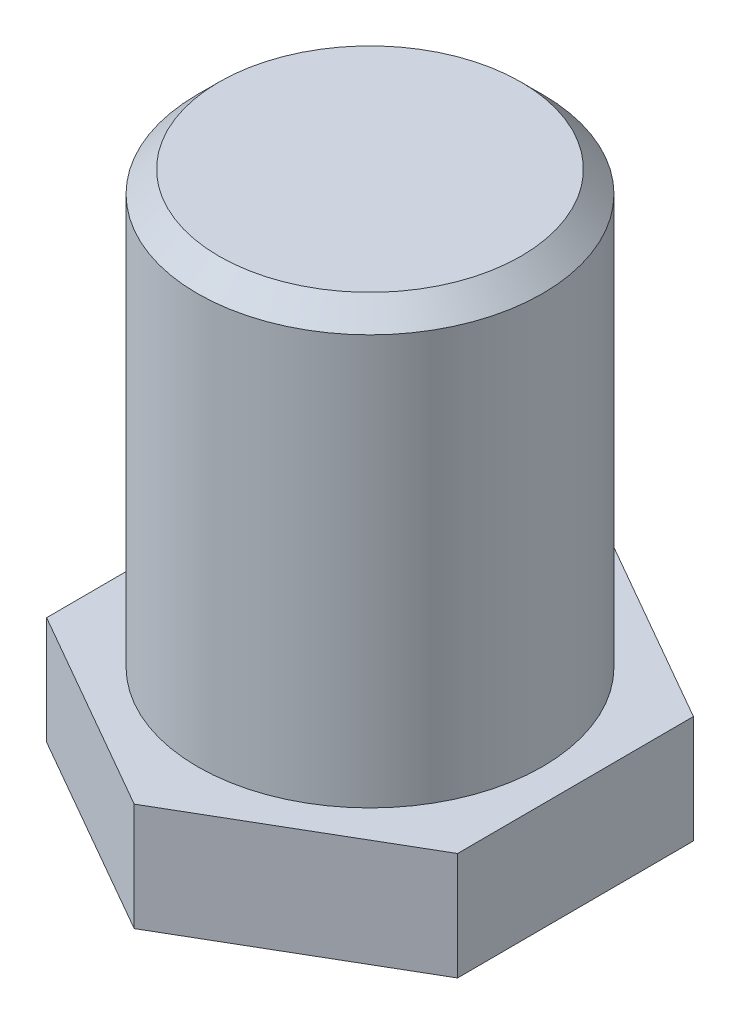
ISO-10303-21;
HEADER;
FILE_DESCRIPTION(('STEP AP214'),'2;1');
FILE_NAME('part.step','',(''),(''),'','','');
FILE_SCHEMA(('AUTOMOTIVE_DESIGN { 1 0 10303 214 1 1 1 1 }'));
ENDSEC;
DATA;
#1=APPLICATION_CONTEXT('core data for automotive mechanical design processes');
#2=APPLICATION_PROTOCOL_DEFINITION('international standard','automotive_design',2000,#1);
#3=PRODUCT_CONTEXT('',#1,'mechanical');
#4=PRODUCT('Part','Part','',(#3));
#5=PRODUCT_RELATED_PRODUCT_CATEGORY('part','',(#4));
#6=PRODUCT_DEFINITION_FORMATION('','',#4);
#7=PRODUCT_DEFINITION_CONTEXT('part definition',#1,'design');
#8=PRODUCT_DEFINITION('design','',#6,#7);
#9=PRODUCT_DEFINITION_SHAPE('','',#8);
#10=(LENGTH_UNIT() NAMED_UNIT(*) SI_UNIT(.MILLI.,.METRE.));
#11=(NAMED_UNIT(*) PLANE_ANGLE_UNIT() SI_UNIT($,.RADIAN.));
#12=(NAMED_UNIT(*) SI_UNIT($,.STERADIAN.) SOLID_ANGLE_UNIT());
#13=UNCERTAINTY_MEASURE_WITH_UNIT(LENGTH_MEASURE(1.E-05),#10,'distance_accuracy_value','');
#14=(GEOMETRIC_REPRESENTATION_CONTEXT(3) GLOBAL_UNCERTAINTY_ASSIGNED_CONTEXT((#13)) GLOBAL_UNIT_ASSIGNED_CONTEXT((#10,
#11,#12)) REPRESENTATION_CONTEXT('',''));
#15=CARTESIAN_POINT('',(0.,0.,0.));
#16=DIRECTION('',(0.,0.,1.));
#17=DIRECTION('',(1.,0.,0.));
#18=AXIS2_PLACEMENT_3D('',#15,#16,#17);
#19=CARTESIAN_POINT('',(9.51717727629013,5.,5.45496746323935));
#20=DIRECTION('',(0.,1.,0.));
#21=DIRECTION('',(0.,0.,1.));
#22=AXIS2_PLACEMENT_3D('',#19,#20,#21);
#23=PLANE('',#22);
#24=DIRECTION('',(0.86445097307612,0.,-0.502717132339598));
#25=VECTOR('',#24,1.);
#26=CARTESIAN_POINT('',(0.0344482381622272,5.,10.9696010252069));
#27=LINE('',#26,#25);
#28=CARTESIAN_POINT('',(0.0344482381622272,5.,10.9696010252069));
#29=VERTEX_POINT('',#28);
#30=CARTESIAN_POINT('',(9.51717727629013,5.,5.45496746323935));
#31=VERTEX_POINT('',#30);
#32=EDGE_CURVE('E130',#29,#31,#27,.T.);
#33=ORIENTED_EDGE('',*,*,#32,.T.);
#34=DIRECTION('',(-0.0031403209856953,0.,-0.999995069179897));
#35=VECTOR('',#34,1.);
#36=CARTESIAN_POINT('',(9.51717727629013,5.,5.45496746323935));
#37=LINE('',#36,#35);
#38=CARTESIAN_POINT('',(9.4827290381279,5.,-5.51463356196757));
#39=VERTEX_POINT('',#38);
#40=EDGE_CURVE('E88',#31,#39,#37,.T.);
#41=ORIENTED_EDGE('',*,*,#40,.T.);
#42=DIRECTION('',(-0.867591294061816,0.,-0.497277936840299));
#43=VECTOR('',#42,1.);
#44=CARTESIAN_POINT('',(9.4827290381279,5.,-5.51463356196757));
#45=LINE('',#44,#43);
#46=CARTESIAN_POINT('',(-0.0344482381622277,5.,-10.9696010252069));
#47=VERTEX_POINT('',#46);
#48=EDGE_CURVE('E101',#39,#47,#45,.T.);
#49=ORIENTED_EDGE('',*,*,#48,.T.);
#50=DIRECTION('',(-0.86445097307612,0.,0.502717132339598));
#51=VECTOR('',#50,1.);
#52=CARTESIAN_POINT('',(-0.0344482381622277,5.,-10.9696010252069));
#53=LINE('',#52,#51);
#54=CARTESIAN_POINT('',(-9.51717727629013,5.,-5.45496746323936));
#55=VERTEX_POINT('',#54);
#56=EDGE_CURVE('E95',#47,#55,#53,.T.);
#57=ORIENTED_EDGE('',*,*,#56,.T.);
#58=DIRECTION('',(0.00314032098569546,0.,0.999995069179897));
#59=VECTOR('',#58,1.);
#60=CARTESIAN_POINT('',(-9.51717727629013,5.,-5.45496746323936));
#61=LINE('',#60,#59);
#62=CARTESIAN_POINT('',(-9.48272903812791,5.,5.51463356196757));
#63=VERTEX_POINT('',#62);
#64=EDGE_CURVE('E99',#55,#63,#61,.T.);
#65=ORIENTED_EDGE('',*,*,#64,.T.);
#66=DIRECTION('',(0.867591294061816,0.,0.497277936840299));
#67=VECTOR('',#66,1.);
#68=CARTESIAN_POINT('',(-9.48272903812791,5.,5.51463356196757));
#69=LINE('',#68,#67);
#70=EDGE_CURVE('E50',#63,#29,#69,.T.);
#71=ORIENTED_EDGE('',*,*,#70,.T.);
#72=EDGE_LOOP('',(#33,#41,#49,#57,#65,#71));
#73=FACE_BOUND('',#72,.T.);
#74=CARTESIAN_POINT('',(0.,5.,0.));
#75=DIRECTION('',(0.,1.,0.));
#76=DIRECTION('',(0.,0.,1.));
#77=AXIS2_PLACEMENT_3D('',#74,#75,#76);
#78=CIRCLE('',#77,8.);
#79=CARTESIAN_POINT('',(0.,5.,8.));
#80=VERTEX_POINT('',#79);
#81=EDGE_CURVE('E123',#80,#80,#78,.F.);
#82=ORIENTED_EDGE('',*,*,#81,.T.);
#83=EDGE_LOOP('',(#82));
#84=FACE_BOUND('',#83,.T.);
#85=ADVANCED_FACE('F33',(#73,#84),#23,.T.);
#86=CARTESIAN_POINT('',(0.0344482381622272,5.,10.9696010252069));
#87=DIRECTION('',(-0.502717132339598,0.,-0.86445097307612));
#88=DIRECTION('',(-0.86445097307612,0.,0.502717132339598));
#89=AXIS2_PLACEMENT_3D('',#86,#87,#88);
#90=PLANE('',#89);
#91=DIRECTION('',(0.86445097307612,0.,-0.502717132339598));
#92=VECTOR('',#91,1.);
#93=CARTESIAN_POINT('',(0.0344482381622272,0.,10.9696010252069));
#94=LINE('',#93,#92);
#95=CARTESIAN_POINT('',(0.0344482381622272,0.,10.9696010252069));
#96=VERTEX_POINT('',#95);
#97=CARTESIAN_POINT('',(9.51717727629013,0.,5.45496746323935));
#98=VERTEX_POINT('',#97);
#99=EDGE_CURVE('E119',#96,#98,#94,.T.);
#100=ORIENTED_EDGE('',*,*,#99,.T.);
#101=DIRECTION('',(0.,-1.,0.));
#102=VECTOR('',#101,1.);
#103=CARTESIAN_POINT('',(9.51717727629013,5.,5.45496746323935));
#104=LINE('',#103,#102);
#105=EDGE_CURVE('E137',#31,#98,#104,.T.);
#106=ORIENTED_EDGE('',*,*,#105,.F.);
#107=ORIENTED_EDGE('',*,*,#32,.F.);
#108=DIRECTION('',(0.,-1.,0.));
#109=VECTOR('',#108,1.);
#110=CARTESIAN_POINT('',(0.0344482381622272,5.,10.9696010252069));
#111=LINE('',#110,#109);
#112=EDGE_CURVE('E115',#29,#96,#111,.T.);
#113=ORIENTED_EDGE('',*,*,#112,.T.);
#114=EDGE_LOOP('',(#100,#106,#107,#113));
#115=FACE_BOUND('',#114,.T.);
#116=ADVANCED_FACE('F152',(#115),#90,.F.);
#117=CARTESIAN_POINT('',(9.51717727629013,5.,5.45496746323935));
#118=DIRECTION('',(-0.999995069179897,0.,0.0031403209856953));
#119=DIRECTION('',(0.0031403209856953,0.,0.999995069179897));
#120=AXIS2_PLACEMENT_3D('',#117,#118,#119);
#121=PLANE('',#120);
#122=DIRECTION('',(-0.0031403209856953,0.,-0.999995069179897));
#123=VECTOR('',#122,1.);
#124=CARTESIAN_POINT('',(9.51717727629013,0.,5.45496746323935));
#125=LINE('',#124,#123);
#126=CARTESIAN_POINT('',(9.4827290381279,0.,-5.51463356196757));
#127=VERTEX_POINT('',#126);
#128=EDGE_CURVE('E122',#98,#127,#125,.T.);
#129=ORIENTED_EDGE('',*,*,#128,.T.);
#130=DIRECTION('',(0.,-1.,0.));
#131=VECTOR('',#130,1.);
#132=CARTESIAN_POINT('',(9.4827290381279,5.,-5.51463356196757));
#133=LINE('',#132,#131);
#134=EDGE_CURVE('E134',#39,#127,#133,.T.);
#135=ORIENTED_EDGE('',*,*,#134,.F.);
#136=ORIENTED_EDGE('',*,*,#40,.F.);
#137=ORIENTED_EDGE('',*,*,#105,.T.);
#138=EDGE_LOOP('',(#129,#135,#136,#137));
#139=FACE_BOUND('',#138,.T.);
#140=ADVANCED_FACE('F157',(#139),#121,.F.);
#141=CARTESIAN_POINT('',(9.4827290381279,5.,-5.51463356196757));
#142=DIRECTION('',(-0.497277936840299,0.,0.867591294061816));
#143=DIRECTION('',(0.867591294061816,0.,0.497277936840299));
#144=AXIS2_PLACEMENT_3D('',#141,#142,#143);
#145=PLANE('',#144);
#146=DIRECTION('',(-0.867591294061816,0.,-0.497277936840299));
#147=VECTOR('',#146,1.);
#148=CARTESIAN_POINT('',(9.4827290381279,0.,-5.51463356196757));
#149=LINE('',#148,#147);
#150=CARTESIAN_POINT('',(-0.0344482381622277,0.,-10.9696010252069));
#151=VERTEX_POINT('',#150);
#152=EDGE_CURVE('E125',#127,#151,#149,.T.);
#153=ORIENTED_EDGE('',*,*,#152,.T.);
#154=DIRECTION('',(0.,-1.,0.));
#155=VECTOR('',#154,1.);
#156=CARTESIAN_POINT('',(-0.0344482381622277,5.,-10.9696010252069));
#157=LINE('',#156,#155);
#158=EDGE_CURVE('E110',#47,#151,#157,.T.);
#159=ORIENTED_EDGE('',*,*,#158,.F.);
#160=ORIENTED_EDGE('',*,*,#48,.F.);
#161=ORIENTED_EDGE('',*,*,#134,.T.);
#162=EDGE_LOOP('',(#153,#159,#160,#161));
#163=FACE_BOUND('',#162,.T.);
#164=ADVANCED_FACE('F172',(#163),#145,.F.);
#165=CARTESIAN_POINT('',(-0.0344482381622277,5.,-10.9696010252069));
#166=DIRECTION('',(0.502717132339598,0.,0.86445097307612));
#167=DIRECTION('',(0.86445097307612,0.,-0.502717132339598));
#168=AXIS2_PLACEMENT_3D('',#165,#166,#167);
#169=PLANE('',#168);
#170=DIRECTION('',(-0.86445097307612,0.,0.502717132339598));
#171=VECTOR('',#170,1.);
#172=CARTESIAN_POINT('',(-0.0344482381622277,0.,-10.9696010252069));
#173=LINE('',#172,#171);
#174=CARTESIAN_POINT('',(-9.51717727629013,0.,-5.45496746323936));
#175=VERTEX_POINT('',#174);
#176=EDGE_CURVE('E109',#151,#175,#173,.T.);
#177=ORIENTED_EDGE('',*,*,#176,.T.);
#178=DIRECTION('',(0.,-1.,0.));
#179=VECTOR('',#178,1.);
#180=CARTESIAN_POINT('',(-9.51717727629013,5.,-5.45496746323936));
#181=LINE('',#180,#179);
#182=EDGE_CURVE('E106',#55,#175,#181,.T.);
#183=ORIENTED_EDGE('',*,*,#182,.F.);
#184=ORIENTED_EDGE('',*,*,#56,.F.);
#185=ORIENTED_EDGE('',*,*,#158,.T.);
#186=EDGE_LOOP('',(#177,#183,#184,#185));
#187=FACE_BOUND('',#186,.T.);
#188=ADVANCED_FACE('F107',(#187),#169,.F.);
#189=CARTESIAN_POINT('',(-9.51717727629013,5.,-5.45496746323936));
#190=DIRECTION('',(0.999995069179897,0.,-0.00314032098569546));
#191=DIRECTION('',(-0.00314032098569546,0.,-0.999995069179897));
#192=AXIS2_PLACEMENT_3D('',#189,#190,#191);
#193=PLANE('',#192);
#194=DIRECTION('',(0.00314032098569546,0.,0.999995069179897));
#195=VECTOR('',#194,1.);
#196=CARTESIAN_POINT('',(-9.51717727629013,0.,-5.45496746323936));
#197=LINE('',#196,#195);
#198=CARTESIAN_POINT('',(-9.48272903812791,0.,5.51463356196757));
#199=VERTEX_POINT('',#198);
#200=EDGE_CURVE('E73',#175,#199,#197,.T.);
#201=ORIENTED_EDGE('',*,*,#200,.T.);
#202=DIRECTION('',(0.,-1.,0.));
#203=VECTOR('',#202,1.);
#204=CARTESIAN_POINT('',(-9.48272903812791,5.,5.51463356196757));
#205=LINE('',#204,#203);
#206=EDGE_CURVE('E111',#63,#199,#205,.T.);
#207=ORIENTED_EDGE('',*,*,#206,.F.);
#208=ORIENTED_EDGE('',*,*,#64,.F.);
#209=ORIENTED_EDGE('',*,*,#182,.T.);
#210=EDGE_LOOP('',(#201,#207,#208,#209));
#211=FACE_BOUND('',#210,.T.);
#212=ADVANCED_FACE('F113',(#211),#193,.F.);
#213=CARTESIAN_POINT('',(-9.48272903812791,5.,5.51463356196757));
#214=DIRECTION('',(0.497277936840299,0.,-0.867591294061816));
#215=DIRECTION('',(-0.867591294061816,0.,-0.497277936840299));
#216=AXIS2_PLACEMENT_3D('',#213,#214,#215);
#217=PLANE('',#216);
#218=DIRECTION('',(0.867591294061816,0.,0.497277936840299));
#219=VECTOR('',#218,1.);
#220=CARTESIAN_POINT('',(-9.48272903812791,0.,5.51463356196757));
#221=LINE('',#220,#219);
#222=EDGE_CURVE('E79',#199,#96,#221,.T.);
#223=ORIENTED_EDGE('',*,*,#222,.T.);
#224=ORIENTED_EDGE('',*,*,#112,.F.);
#225=ORIENTED_EDGE('',*,*,#70,.F.);
#226=ORIENTED_EDGE('',*,*,#206,.T.);
#227=EDGE_LOOP('',(#223,#224,#225,#226));
#228=FACE_BOUND('',#227,.T.);
#229=ADVANCED_FACE('F164',(#228),#217,.F.);
#230=CARTESIAN_POINT('',(9.51717727629013,0.,5.45496746323935));
#231=DIRECTION('',(0.,1.,0.));
#232=DIRECTION('',(0.,0.,1.));
#233=AXIS2_PLACEMENT_3D('',#230,#231,#232);
#234=PLANE('',#233);
#235=ORIENTED_EDGE('',*,*,#99,.F.);
#236=ORIENTED_EDGE('',*,*,#222,.F.);
#237=ORIENTED_EDGE('',*,*,#200,.F.);
#238=ORIENTED_EDGE('',*,*,#176,.F.);
#239=ORIENTED_EDGE('',*,*,#152,.F.);
#240=ORIENTED_EDGE('',*,*,#128,.F.);
#241=EDGE_LOOP('',(#235,#236,#237,#238,#239,#240));
#242=FACE_BOUND('',#241,.T.);
#243=ADVANCED_FACE('F161',(#242),#234,.F.);
#244=CARTESIAN_POINT('',(0.,25.,0.));
#245=DIRECTION('',(0.,-1.,0.));
#246=DIRECTION('',(0.,0.,-1.));
#247=AXIS2_PLACEMENT_3D('',#244,#245,#246);
#248=CYLINDRICAL_SURFACE('',#247,8.);
#249=CARTESIAN_POINT('',(0.,24.,0.));
#250=DIRECTION('',(0.,1.,0.));
#251=DIRECTION('',(0.,0.,1.));
#252=AXIS2_PLACEMENT_3D('',#249,#250,#251);
#253=CIRCLE('',#252,8.);
#254=CARTESIAN_POINT('',(0.,24.,8.));
#255=VERTEX_POINT('',#254);
#256=EDGE_CURVE('E11',#255,#255,#253,.F.);
#257=ORIENTED_EDGE('',*,*,#256,.T.);
#258=EDGE_LOOP('',(#257));
#259=FACE_BOUND('',#258,.T.);
#260=ORIENTED_EDGE('',*,*,#81,.F.);
#261=EDGE_LOOP('',(#260));
#262=FACE_BOUND('',#261,.T.);
#263=ADVANCED_FACE('F148',(#259,#262),#248,.T.);
#264=CARTESIAN_POINT('',(0.,25.,0.));
#265=DIRECTION('',(0.,1.,0.));
#266=DIRECTION('',(0.,0.,1.));
#267=AXIS2_PLACEMENT_3D('',#264,#265,#266);
#268=PLANE('',#267);
#269=CARTESIAN_POINT('',(0.,25.,0.));
#270=DIRECTION('',(0.,1.,0.));
#271=DIRECTION('',(0.,0.,1.));
#272=AXIS2_PLACEMENT_3D('',#269,#270,#271);
#273=CIRCLE('',#272,7.00000000000002);
#274=CARTESIAN_POINT('',(0.,25.,7.00000000000002));
#275=VERTEX_POINT('',#274);
#276=EDGE_CURVE('E42',#275,#275,#273,.T.);
#277=ORIENTED_EDGE('',*,*,#276,.T.);
#278=EDGE_LOOP('',(#277));
#279=FACE_BOUND('',#278,.T.);
#280=ADVANCED_FACE('F141',(#279),#268,.T.);
#281=CARTESIAN_POINT('',(0.,25.,0.));
#282=DIRECTION('',(0.,-1.,0.));
#283=DIRECTION('',(0.,0.,-1.));
#284=AXIS2_PLACEMENT_3D('',#281,#282,#283);
#285=CONICAL_SURFACE('',#284,7.00000000000002,0.785398163397444);
#286=ORIENTED_EDGE('',*,*,#256,.F.);
#287=EDGE_LOOP('',(#286));
#288=FACE_BOUND('',#287,.T.);
#289=ORIENTED_EDGE('',*,*,#276,.F.);
#290=EDGE_LOOP('',(#289));
#291=FACE_BOUND('',#290,.T.);
#292=ADVANCED_FACE('F35',(#288,#291),#285,.T.);
#293=CLOSED_SHELL('',(#85,#116,#140,#164,#188,#212,#229,#243,#263,#280,#292));
#294=MANIFOLD_SOLID_BREP('B2',#293);
#295=ADVANCED_BREP_SHAPE_REPRESENTATION('',(#18,#294),#14);
#296=SHAPE_DEFINITION_REPRESENTATION(#9,#295);
ENDSEC;
END-ISO-10303-21;
